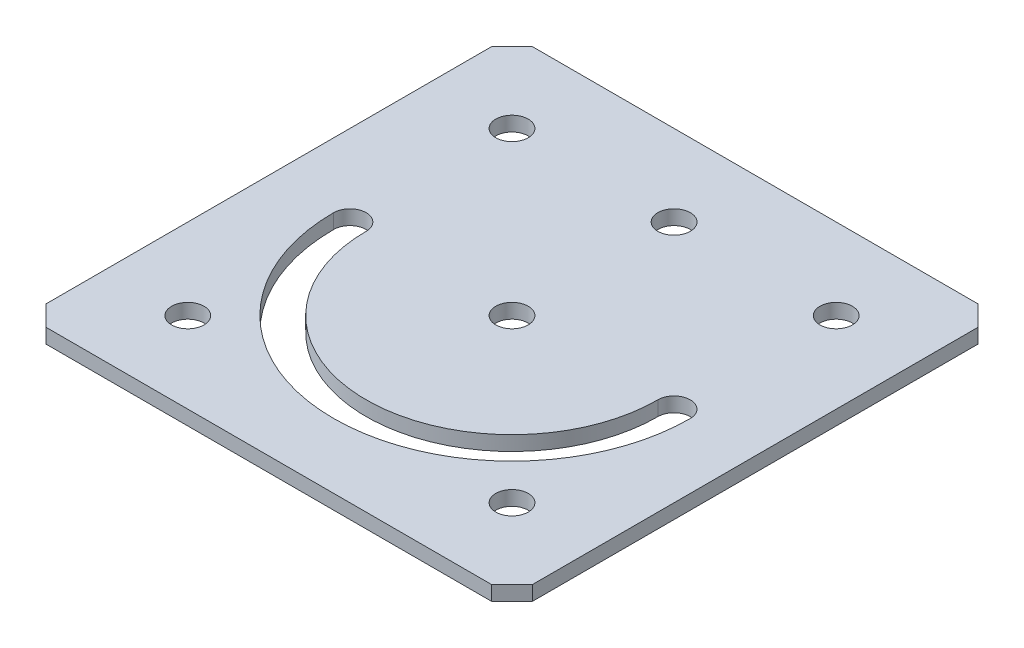
ISO-10303-21;
HEADER;
FILE_DESCRIPTION(('STEP AP214'),'2;1');
FILE_NAME('part.step','',(''),(''),'','','');
FILE_SCHEMA(('AUTOMOTIVE_DESIGN { 1 0 10303 214 1 1 1 1 }'));
ENDSEC;
DATA;
#1=APPLICATION_CONTEXT('core data for automotive mechanical design processes');
#2=APPLICATION_PROTOCOL_DEFINITION('international standard','automotive_design',2000,#1);
#3=PRODUCT_CONTEXT('',#1,'mechanical');
#4=PRODUCT('Part','Part','',(#3));
#5=PRODUCT_RELATED_PRODUCT_CATEGORY('part','',(#4));
#6=PRODUCT_DEFINITION_FORMATION('','',#4);
#7=PRODUCT_DEFINITION_CONTEXT('part definition',#1,'design');
#8=PRODUCT_DEFINITION('design','',#6,#7);
#9=PRODUCT_DEFINITION_SHAPE('','',#8);
#10=(LENGTH_UNIT() NAMED_UNIT(*) SI_UNIT(.MILLI.,.METRE.));
#11=(NAMED_UNIT(*) PLANE_ANGLE_UNIT() SI_UNIT($,.RADIAN.));
#12=(NAMED_UNIT(*) SI_UNIT($,.STERADIAN.) SOLID_ANGLE_UNIT());
#13=UNCERTAINTY_MEASURE_WITH_UNIT(LENGTH_MEASURE(1.E-05),#10,'distance_accuracy_value','');
#14=(GEOMETRIC_REPRESENTATION_CONTEXT(3) GLOBAL_UNCERTAINTY_ASSIGNED_CONTEXT((#13)) GLOBAL_UNIT_ASSIGNED_CONTEXT((#10,
#11,#12)) REPRESENTATION_CONTEXT('',''));
#15=CARTESIAN_POINT('',(0.,0.,0.));
#16=DIRECTION('',(0.,0.,1.));
#17=DIRECTION('',(1.,0.,0.));
#18=AXIS2_PLACEMENT_3D('',#15,#16,#17);
#19=CARTESIAN_POINT('',(0.,3.,0.));
#20=DIRECTION('',(0.,1.,0.));
#21=DIRECTION('',(0.,0.,1.));
#22=AXIS2_PLACEMENT_3D('',#19,#20,#21);
#23=PLANE('',#22);
#24=DIRECTION('',(0.707106781186544,0.,0.707106781186551));
#25=VECTOR('',#24,1.);
#26=CARTESIAN_POINT('',(-63.5,3.,60.325));
#27=LINE('',#26,#25);
#28=CARTESIAN_POINT('',(-60.325,3.,63.5));
#29=VERTEX_POINT('',#28);
#30=CARTESIAN_POINT('',(-63.5,3.,60.3249999999999));
#31=VERTEX_POINT('',#30);
#32=EDGE_CURVE('E435',#29,#31,#27,.F.);
#33=ORIENTED_EDGE('',*,*,#32,.F.);
#34=DIRECTION('',(1.,0.,0.));
#35=VECTOR('',#34,1.);
#36=CARTESIAN_POINT('',(-60.325,3.,63.5));
#37=LINE('',#36,#35);
#38=CARTESIAN_POINT('',(9.52499999999996,3.,63.5));
#39=VERTEX_POINT('',#38);
#40=EDGE_CURVE('E439',#39,#29,#37,.F.);
#41=ORIENTED_EDGE('',*,*,#40,.F.);
#42=DIRECTION('',(0.70710678118655,0.,-0.707106781186546));
#43=VECTOR('',#42,1.);
#44=CARTESIAN_POINT('',(9.52499999999996,3.,63.5));
#45=LINE('',#44,#43);
#46=CARTESIAN_POINT('',(12.7,3.,60.325));
#47=VERTEX_POINT('',#46);
#48=EDGE_CURVE('E443',#47,#39,#45,.F.);
#49=ORIENTED_EDGE('',*,*,#48,.F.);
#50=DIRECTION('',(0.,0.,-1.));
#51=VECTOR('',#50,1.);
#52=CARTESIAN_POINT('',(12.7,3.,60.325));
#53=LINE('',#52,#51);
#54=CARTESIAN_POINT('',(12.7,3.,-9.52499999999999));
#55=VERTEX_POINT('',#54);
#56=EDGE_CURVE('E160',#55,#47,#53,.F.);
#57=ORIENTED_EDGE('',*,*,#56,.F.);
#58=DIRECTION('',(-0.707106781186546,0.,-0.707106781186549));
#59=VECTOR('',#58,1.);
#60=CARTESIAN_POINT('',(12.7,3.,-9.52499999999999));
#61=LINE('',#60,#59);
#62=CARTESIAN_POINT('',(9.525,3.,-12.7));
#63=VERTEX_POINT('',#62);
#64=EDGE_CURVE('E419',#63,#55,#61,.F.);
#65=ORIENTED_EDGE('',*,*,#64,.F.);
#66=DIRECTION('',(-1.,0.,0.));
#67=VECTOR('',#66,1.);
#68=CARTESIAN_POINT('',(9.525,3.,-12.7));
#69=LINE('',#68,#67);
#70=CARTESIAN_POINT('',(-60.325,3.,-12.7));
#71=VERTEX_POINT('',#70);
#72=EDGE_CURVE('E423',#71,#63,#69,.F.);
#73=ORIENTED_EDGE('',*,*,#72,.F.);
#74=DIRECTION('',(-0.707106781186549,0.,0.707106781186546));
#75=VECTOR('',#74,1.);
#76=CARTESIAN_POINT('',(-60.325,3.,-12.7));
#77=LINE('',#76,#75);
#78=CARTESIAN_POINT('',(-63.5,3.,-9.52499999999999));
#79=VERTEX_POINT('',#78);
#80=EDGE_CURVE('E427',#79,#71,#77,.F.);
#81=ORIENTED_EDGE('',*,*,#80,.F.);
#82=DIRECTION('',(0.,0.,1.));
#83=VECTOR('',#82,1.);
#84=CARTESIAN_POINT('',(-63.5,3.,-9.52499999999999));
#85=LINE('',#84,#83);
#86=EDGE_CURVE('E431',#31,#79,#85,.F.);
#87=ORIENTED_EDGE('',*,*,#86,.F.);
#88=EDGE_LOOP('',(#33,#41,#49,#57,#65,#73,#81,#87));
#89=FACE_BOUND('',#88,.T.);
#90=CARTESIAN_POINT('',(-50.8,3.,25.4));
#91=DIRECTION('',(0.,1.,0.));
#92=DIRECTION('',(0.,0.,1.));
#93=AXIS2_PLACEMENT_3D('',#90,#91,#92);
#94=CIRCLE('',#93,2.54);
#95=CARTESIAN_POINT('',(-53.34,3.,25.4));
#96=VERTEX_POINT('',#95);
#97=CARTESIAN_POINT('',(-48.26,3.,25.4));
#98=VERTEX_POINT('',#97);
#99=EDGE_CURVE('E107',#96,#98,#94,.F.);
#100=ORIENTED_EDGE('',*,*,#99,.T.);
#101=CARTESIAN_POINT('',(-25.4,3.,25.4));
#102=DIRECTION('',(0.,1.,0.));
#103=DIRECTION('',(0.,0.,1.));
#104=AXIS2_PLACEMENT_3D('',#101,#102,#103);
#105=CIRCLE('',#104,22.86);
#106=CARTESIAN_POINT('',(-2.53999999999999,3.,25.4));
#107=VERTEX_POINT('',#106);
#108=EDGE_CURVE('E162',#107,#98,#105,.F.);
#109=ORIENTED_EDGE('',*,*,#108,.F.);
#110=CARTESIAN_POINT('',(0.,3.,25.4));
#111=DIRECTION('',(0.,1.,0.));
#112=DIRECTION('',(0.,0.,1.));
#113=AXIS2_PLACEMENT_3D('',#110,#111,#112);
#114=CIRCLE('',#113,2.54);
#115=CARTESIAN_POINT('',(2.54000000000001,3.,25.4));
#116=VERTEX_POINT('',#115);
#117=EDGE_CURVE('E110',#107,#116,#114,.F.);
#118=ORIENTED_EDGE('',*,*,#117,.T.);
#119=CARTESIAN_POINT('',(-25.4,3.,25.4));
#120=DIRECTION('',(0.,1.,0.));
#121=DIRECTION('',(0.,0.,1.));
#122=AXIS2_PLACEMENT_3D('',#119,#120,#121);
#123=CIRCLE('',#122,27.94);
#124=EDGE_CURVE('E104',#116,#96,#123,.F.);
#125=ORIENTED_EDGE('',*,*,#124,.T.);
#126=EDGE_LOOP('',(#100,#109,#118,#125));
#127=FACE_BOUND('',#126,.T.);
#128=CARTESIAN_POINT('',(0.,3.,0.));
#129=DIRECTION('',(0.,1.,0.));
#130=DIRECTION('',(0.,0.,1.));
#131=AXIS2_PLACEMENT_3D('',#128,#129,#130);
#132=CIRCLE('',#131,2.54);
#133=CARTESIAN_POINT('',(0.,3.,2.54000000000001));
#134=VERTEX_POINT('',#133);
#135=EDGE_CURVE('E116',#134,#134,#132,.F.);
#136=ORIENTED_EDGE('',*,*,#135,.T.);
#137=EDGE_LOOP('',(#136));
#138=FACE_BOUND('',#137,.T.);
#139=CARTESIAN_POINT('',(-25.4,3.,0.));
#140=DIRECTION('',(0.,1.,0.));
#141=DIRECTION('',(0.,0.,1.));
#142=AXIS2_PLACEMENT_3D('',#139,#140,#141);
#143=CIRCLE('',#142,2.54);
#144=CARTESIAN_POINT('',(-25.4,3.,2.54000000000001));
#145=VERTEX_POINT('',#144);
#146=EDGE_CURVE('E167',#145,#145,#143,.F.);
#147=ORIENTED_EDGE('',*,*,#146,.T.);
#148=EDGE_LOOP('',(#147));
#149=FACE_BOUND('',#148,.T.);
#150=CARTESIAN_POINT('',(-50.8,3.,0.));
#151=DIRECTION('',(0.,1.,0.));
#152=DIRECTION('',(0.,0.,1.));
#153=AXIS2_PLACEMENT_3D('',#150,#151,#152);
#154=CIRCLE('',#153,2.54);
#155=CARTESIAN_POINT('',(-50.8,3.,2.54000000000001));
#156=VERTEX_POINT('',#155);
#157=EDGE_CURVE('E170',#156,#156,#154,.F.);
#158=ORIENTED_EDGE('',*,*,#157,.T.);
#159=EDGE_LOOP('',(#158));
#160=FACE_BOUND('',#159,.T.);
#161=CARTESIAN_POINT('',(-25.4,3.,25.4));
#162=DIRECTION('',(0.,1.,0.));
#163=DIRECTION('',(0.,0.,1.));
#164=AXIS2_PLACEMENT_3D('',#161,#162,#163);
#165=CIRCLE('',#164,2.54);
#166=CARTESIAN_POINT('',(-25.4,3.,27.94));
#167=VERTEX_POINT('',#166);
#168=EDGE_CURVE('E173',#167,#167,#165,.F.);
#169=ORIENTED_EDGE('',*,*,#168,.T.);
#170=EDGE_LOOP('',(#169));
#171=FACE_BOUND('',#170,.T.);
#172=CARTESIAN_POINT('',(0.,3.,50.8));
#173=DIRECTION('',(0.,1.,0.));
#174=DIRECTION('',(0.,0.,1.));
#175=AXIS2_PLACEMENT_3D('',#172,#173,#174);
#176=CIRCLE('',#175,2.54);
#177=CARTESIAN_POINT('',(0.,3.,53.34));
#178=VERTEX_POINT('',#177);
#179=EDGE_CURVE('E175',#178,#178,#176,.F.);
#180=ORIENTED_EDGE('',*,*,#179,.T.);
#181=EDGE_LOOP('',(#180));
#182=FACE_BOUND('',#181,.T.);
#183=CARTESIAN_POINT('',(-50.8,3.,50.8));
#184=DIRECTION('',(0.,1.,0.));
#185=DIRECTION('',(0.,0.,1.));
#186=AXIS2_PLACEMENT_3D('',#183,#184,#185);
#187=CIRCLE('',#186,2.54);
#188=CARTESIAN_POINT('',(-50.8,3.,53.34));
#189=VERTEX_POINT('',#188);
#190=EDGE_CURVE('E21',#189,#189,#187,.F.);
#191=ORIENTED_EDGE('',*,*,#190,.T.);
#192=EDGE_LOOP('',(#191));
#193=FACE_BOUND('',#192,.T.);
#194=ADVANCED_FACE('F18',(#89,#127,#138,#149,#160,#171,#182,#193),#23,.T.);
#195=CARTESIAN_POINT('',(-50.8,0.714,50.8));
#196=DIRECTION('',(0.,1.,0.));
#197=DIRECTION('',(0.,0.,1.));
#198=AXIS2_PLACEMENT_3D('',#195,#196,#197);
#199=CYLINDRICAL_SURFACE('',#198,2.54);
#200=CARTESIAN_POINT('',(-50.8,0.714,50.8));
#201=DIRECTION('',(0.,1.,0.));
#202=DIRECTION('',(0.,0.,1.));
#203=AXIS2_PLACEMENT_3D('',#200,#201,#202);
#204=CIRCLE('',#203,2.54);
#205=CARTESIAN_POINT('',(-50.8,0.714,53.34));
#206=VERTEX_POINT('',#205);
#207=EDGE_CURVE('E155',#206,#206,#204,.F.);
#208=ORIENTED_EDGE('',*,*,#207,.T.);
#209=EDGE_LOOP('',(#208));
#210=FACE_BOUND('',#209,.T.);
#211=ORIENTED_EDGE('',*,*,#190,.F.);
#212=EDGE_LOOP('',(#211));
#213=FACE_BOUND('',#212,.T.);
#214=ADVANCED_FACE('F183',(#210,#213),#199,.F.);
#215=CARTESIAN_POINT('',(0.,0.714,50.8));
#216=DIRECTION('',(0.,1.,0.));
#217=DIRECTION('',(0.,0.,1.));
#218=AXIS2_PLACEMENT_3D('',#215,#216,#217);
#219=CYLINDRICAL_SURFACE('',#218,2.54);
#220=CARTESIAN_POINT('',(0.,0.714,50.8));
#221=DIRECTION('',(0.,1.,0.));
#222=DIRECTION('',(0.,0.,1.));
#223=AXIS2_PLACEMENT_3D('',#220,#221,#222);
#224=CIRCLE('',#223,2.54);
#225=CARTESIAN_POINT('',(0.,0.714,53.34));
#226=VERTEX_POINT('',#225);
#227=EDGE_CURVE('E152',#226,#226,#224,.F.);
#228=ORIENTED_EDGE('',*,*,#227,.T.);
#229=EDGE_LOOP('',(#228));
#230=FACE_BOUND('',#229,.T.);
#231=ORIENTED_EDGE('',*,*,#179,.F.);
#232=EDGE_LOOP('',(#231));
#233=FACE_BOUND('',#232,.T.);
#234=ADVANCED_FACE('F185',(#230,#233),#219,.F.);
#235=CARTESIAN_POINT('',(-25.4,0.714,25.4));
#236=DIRECTION('',(0.,1.,0.));
#237=DIRECTION('',(0.,0.,1.));
#238=AXIS2_PLACEMENT_3D('',#235,#236,#237);
#239=CYLINDRICAL_SURFACE('',#238,2.54);
#240=CARTESIAN_POINT('',(-25.4,0.714,25.4));
#241=DIRECTION('',(0.,1.,0.));
#242=DIRECTION('',(0.,0.,1.));
#243=AXIS2_PLACEMENT_3D('',#240,#241,#242);
#244=CIRCLE('',#243,2.54);
#245=CARTESIAN_POINT('',(-25.4,0.714,27.94));
#246=VERTEX_POINT('',#245);
#247=EDGE_CURVE('E149',#246,#246,#244,.F.);
#248=ORIENTED_EDGE('',*,*,#247,.T.);
#249=EDGE_LOOP('',(#248));
#250=FACE_BOUND('',#249,.T.);
#251=ORIENTED_EDGE('',*,*,#168,.F.);
#252=EDGE_LOOP('',(#251));
#253=FACE_BOUND('',#252,.T.);
#254=ADVANCED_FACE('F192',(#250,#253),#239,.F.);
#255=CARTESIAN_POINT('',(-50.8,0.714,0.));
#256=DIRECTION('',(0.,1.,0.));
#257=DIRECTION('',(0.,0.,1.));
#258=AXIS2_PLACEMENT_3D('',#255,#256,#257);
#259=CYLINDRICAL_SURFACE('',#258,2.54);
#260=CARTESIAN_POINT('',(-50.8,0.714,0.));
#261=DIRECTION('',(0.,1.,0.));
#262=DIRECTION('',(0.,0.,1.));
#263=AXIS2_PLACEMENT_3D('',#260,#261,#262);
#264=CIRCLE('',#263,2.54);
#265=CARTESIAN_POINT('',(-50.8,0.714,2.54000000000001));
#266=VERTEX_POINT('',#265);
#267=EDGE_CURVE('E146',#266,#266,#264,.F.);
#268=ORIENTED_EDGE('',*,*,#267,.T.);
#269=EDGE_LOOP('',(#268));
#270=FACE_BOUND('',#269,.T.);
#271=ORIENTED_EDGE('',*,*,#157,.F.);
#272=EDGE_LOOP('',(#271));
#273=FACE_BOUND('',#272,.T.);
#274=ADVANCED_FACE('F255',(#270,#273),#259,.F.);
#275=CARTESIAN_POINT('',(-25.4,0.714,0.));
#276=DIRECTION('',(0.,1.,0.));
#277=DIRECTION('',(0.,0.,1.));
#278=AXIS2_PLACEMENT_3D('',#275,#276,#277);
#279=CYLINDRICAL_SURFACE('',#278,2.54);
#280=CARTESIAN_POINT('',(-25.4,0.714,0.));
#281=DIRECTION('',(0.,1.,0.));
#282=DIRECTION('',(0.,0.,1.));
#283=AXIS2_PLACEMENT_3D('',#280,#281,#282);
#284=CIRCLE('',#283,2.54);
#285=CARTESIAN_POINT('',(-25.4,0.714,2.54000000000001));
#286=VERTEX_POINT('',#285);
#287=EDGE_CURVE('E143',#286,#286,#284,.F.);
#288=ORIENTED_EDGE('',*,*,#287,.T.);
#289=EDGE_LOOP('',(#288));
#290=FACE_BOUND('',#289,.T.);
#291=ORIENTED_EDGE('',*,*,#146,.F.);
#292=EDGE_LOOP('',(#291));
#293=FACE_BOUND('',#292,.T.);
#294=ADVANCED_FACE('F251',(#290,#293),#279,.F.);
#295=CARTESIAN_POINT('',(0.,0.714,0.));
#296=DIRECTION('',(0.,1.,0.));
#297=DIRECTION('',(0.,0.,1.));
#298=AXIS2_PLACEMENT_3D('',#295,#296,#297);
#299=CYLINDRICAL_SURFACE('',#298,2.54);
#300=CARTESIAN_POINT('',(0.,0.714,0.));
#301=DIRECTION('',(0.,1.,0.));
#302=DIRECTION('',(0.,0.,1.));
#303=AXIS2_PLACEMENT_3D('',#300,#301,#302);
#304=CIRCLE('',#303,2.54);
#305=CARTESIAN_POINT('',(0.,0.714,2.54000000000001));
#306=VERTEX_POINT('',#305);
#307=EDGE_CURVE('E140',#306,#306,#304,.F.);
#308=ORIENTED_EDGE('',*,*,#307,.T.);
#309=EDGE_LOOP('',(#308));
#310=FACE_BOUND('',#309,.T.);
#311=ORIENTED_EDGE('',*,*,#135,.F.);
#312=EDGE_LOOP('',(#311));
#313=FACE_BOUND('',#312,.T.);
#314=ADVANCED_FACE('F248',(#310,#313),#299,.F.);
#315=CARTESIAN_POINT('',(-25.4,0.714,25.4));
#316=DIRECTION('',(0.,1.,0.));
#317=DIRECTION('',(0.,0.,1.));
#318=AXIS2_PLACEMENT_3D('',#315,#316,#317);
#319=CYLINDRICAL_SURFACE('',#318,27.94);
#320=CARTESIAN_POINT('',(-25.4,0.714,25.4));
#321=DIRECTION('',(0.,1.,0.));
#322=DIRECTION('',(0.,0.,1.));
#323=AXIS2_PLACEMENT_3D('',#320,#321,#322);
#324=CIRCLE('',#323,27.94);
#325=CARTESIAN_POINT('',(2.54000000000001,0.714,25.4));
#326=VERTEX_POINT('',#325);
#327=CARTESIAN_POINT('',(-53.34,0.714,25.4));
#328=VERTEX_POINT('',#327);
#329=EDGE_CURVE('E126',#326,#328,#324,.F.);
#330=ORIENTED_EDGE('',*,*,#329,.T.);
#331=DIRECTION('',(0.,1.,0.));
#332=VECTOR('',#331,1.);
#333=CARTESIAN_POINT('',(-53.34,0.714,25.4));
#334=LINE('',#333,#332);
#335=EDGE_CURVE('E115',#328,#96,#334,.T.);
#336=ORIENTED_EDGE('',*,*,#335,.T.);
#337=ORIENTED_EDGE('',*,*,#124,.F.);
#338=DIRECTION('',(0.,1.,0.));
#339=VECTOR('',#338,1.);
#340=CARTESIAN_POINT('',(2.54,0.714,25.4));
#341=LINE('',#340,#339);
#342=EDGE_CURVE('E163',#116,#326,#341,.F.);
#343=ORIENTED_EDGE('',*,*,#342,.T.);
#344=EDGE_LOOP('',(#330,#336,#337,#343));
#345=FACE_BOUND('',#344,.T.);
#346=ADVANCED_FACE('F125',(#345),#319,.F.);
#347=CARTESIAN_POINT('',(-50.8,0.714,25.4));
#348=DIRECTION('',(0.,1.,0.));
#349=DIRECTION('',(0.,0.,1.));
#350=AXIS2_PLACEMENT_3D('',#347,#348,#349);
#351=CYLINDRICAL_SURFACE('',#350,2.54);
#352=ORIENTED_EDGE('',*,*,#335,.F.);
#353=CARTESIAN_POINT('',(-50.8,0.714,25.4));
#354=DIRECTION('',(0.,1.,0.));
#355=DIRECTION('',(0.,0.,1.));
#356=AXIS2_PLACEMENT_3D('',#353,#354,#355);
#357=CIRCLE('',#356,2.54);
#358=CARTESIAN_POINT('',(-48.26,0.714,25.4));
#359=VERTEX_POINT('',#358);
#360=EDGE_CURVE('E137',#328,#359,#357,.F.);
#361=ORIENTED_EDGE('',*,*,#360,.T.);
#362=DIRECTION('',(0.,1.,0.));
#363=VECTOR('',#362,1.);
#364=CARTESIAN_POINT('',(-48.26,0.714,25.4));
#365=LINE('',#364,#363);
#366=EDGE_CURVE('E123',#98,#359,#365,.F.);
#367=ORIENTED_EDGE('',*,*,#366,.F.);
#368=ORIENTED_EDGE('',*,*,#99,.F.);
#369=EDGE_LOOP('',(#352,#361,#367,#368));
#370=FACE_BOUND('',#369,.T.);
#371=ADVANCED_FACE('F120',(#370),#351,.F.);
#372=CARTESIAN_POINT('',(-25.4,0.714,25.4));
#373=DIRECTION('',(0.,1.,0.));
#374=DIRECTION('',(0.,0.,1.));
#375=AXIS2_PLACEMENT_3D('',#372,#373,#374);
#376=CYLINDRICAL_SURFACE('',#375,22.86);
#377=DIRECTION('',(0.,1.,0.));
#378=VECTOR('',#377,1.);
#379=CARTESIAN_POINT('',(-2.54,0.714,25.4));
#380=LINE('',#379,#378);
#381=CARTESIAN_POINT('',(-2.54,0.714,25.4));
#382=VERTEX_POINT('',#381);
#383=EDGE_CURVE('E161',#382,#107,#380,.T.);
#384=ORIENTED_EDGE('',*,*,#383,.T.);
#385=ORIENTED_EDGE('',*,*,#108,.T.);
#386=ORIENTED_EDGE('',*,*,#366,.T.);
#387=CARTESIAN_POINT('',(-25.4,0.714,25.4));
#388=DIRECTION('',(0.,1.,0.));
#389=DIRECTION('',(0.,0.,1.));
#390=AXIS2_PLACEMENT_3D('',#387,#388,#389);
#391=CIRCLE('',#390,22.86);
#392=EDGE_CURVE('E135',#359,#382,#391,.T.);
#393=ORIENTED_EDGE('',*,*,#392,.T.);
#394=EDGE_LOOP('',(#384,#385,#386,#393));
#395=FACE_BOUND('',#394,.T.);
#396=ADVANCED_FACE('F239',(#395),#376,.T.);
#397=CARTESIAN_POINT('',(0.,0.714,25.4));
#398=DIRECTION('',(0.,1.,0.));
#399=DIRECTION('',(0.,0.,1.));
#400=AXIS2_PLACEMENT_3D('',#397,#398,#399);
#401=CYLINDRICAL_SURFACE('',#400,2.54);
#402=ORIENTED_EDGE('',*,*,#383,.F.);
#403=CARTESIAN_POINT('',(0.,0.714,25.4));
#404=DIRECTION('',(0.,1.,0.));
#405=DIRECTION('',(0.,0.,1.));
#406=AXIS2_PLACEMENT_3D('',#403,#404,#405);
#407=CIRCLE('',#406,2.54);
#408=EDGE_CURVE('E131',#382,#326,#407,.F.);
#409=ORIENTED_EDGE('',*,*,#408,.T.);
#410=ORIENTED_EDGE('',*,*,#342,.F.);
#411=ORIENTED_EDGE('',*,*,#117,.F.);
#412=EDGE_LOOP('',(#402,#409,#410,#411));
#413=FACE_BOUND('',#412,.T.);
#414=ADVANCED_FACE('F235',(#413),#401,.F.);
#415=CARTESIAN_POINT('',(12.7,0.714,60.325));
#416=DIRECTION('',(1.,0.,0.));
#417=DIRECTION('',(0.,0.,-1.));
#418=AXIS2_PLACEMENT_3D('',#415,#416,#417);
#419=PLANE('',#418);
#420=DIRECTION('',(0.,0.,1.));
#421=VECTOR('',#420,1.);
#422=CARTESIAN_POINT('',(12.7,0.714,0.));
#423=LINE('',#422,#421);
#424=CARTESIAN_POINT('',(12.7,0.714,60.325));
#425=VERTEX_POINT('',#424);
#426=CARTESIAN_POINT('',(12.7,0.714,-9.52499999999999));
#427=VERTEX_POINT('',#426);
#428=EDGE_CURVE('E134',#425,#427,#423,.F.);
#429=ORIENTED_EDGE('',*,*,#428,.T.);
#430=DIRECTION('',(0.,1.,0.));
#431=VECTOR('',#430,1.);
#432=CARTESIAN_POINT('',(12.7,0.714,-9.52499999999999));
#433=LINE('',#432,#431);
#434=EDGE_CURVE('E421',#55,#427,#433,.F.);
#435=ORIENTED_EDGE('',*,*,#434,.F.);
#436=ORIENTED_EDGE('',*,*,#56,.T.);
#437=DIRECTION('',(0.,1.,0.));
#438=VECTOR('',#437,1.);
#439=CARTESIAN_POINT('',(12.7,0.714,60.325));
#440=LINE('',#439,#438);
#441=EDGE_CURVE('E158',#425,#47,#440,.T.);
#442=ORIENTED_EDGE('',*,*,#441,.F.);
#443=EDGE_LOOP('',(#429,#435,#436,#442));
#444=FACE_BOUND('',#443,.T.);
#445=ADVANCED_FACE('F231',(#444),#419,.T.);
#446=CARTESIAN_POINT('',(12.7,0.714,-9.52499999999999));
#447=DIRECTION('',(0.707106781186549,0.,-0.707106781186546));
#448=DIRECTION('',(-0.707106781186546,0.,-0.707106781186549));
#449=AXIS2_PLACEMENT_3D('',#446,#447,#448);
#450=PLANE('',#449);
#451=DIRECTION('',(-0.707106781186546,0.,-0.707106781186549));
#452=VECTOR('',#451,1.);
#453=CARTESIAN_POINT('',(12.7,0.714,-9.52499999999999));
#454=LINE('',#453,#452);
#455=CARTESIAN_POINT('',(9.525,0.714,-12.7));
#456=VERTEX_POINT('',#455);
#457=EDGE_CURVE('E450',#427,#456,#454,.T.);
#458=ORIENTED_EDGE('',*,*,#457,.T.);
#459=DIRECTION('',(0.,1.,0.));
#460=VECTOR('',#459,1.);
#461=CARTESIAN_POINT('',(9.525,0.714,-12.7));
#462=LINE('',#461,#460);
#463=EDGE_CURVE('E425',#63,#456,#462,.F.);
#464=ORIENTED_EDGE('',*,*,#463,.F.);
#465=ORIENTED_EDGE('',*,*,#64,.T.);
#466=ORIENTED_EDGE('',*,*,#434,.T.);
#467=EDGE_LOOP('',(#458,#464,#465,#466));
#468=FACE_BOUND('',#467,.T.);
#469=ADVANCED_FACE('F227',(#468),#450,.T.);
#470=CARTESIAN_POINT('',(9.525,0.714,-12.7));
#471=DIRECTION('',(0.,0.,-1.));
#472=DIRECTION('',(-1.,0.,0.));
#473=AXIS2_PLACEMENT_3D('',#470,#471,#472);
#474=PLANE('',#473);
#475=DIRECTION('',(1.,0.,0.));
#476=VECTOR('',#475,1.);
#477=CARTESIAN_POINT('',(0.,0.714,-12.7));
#478=LINE('',#477,#476);
#479=CARTESIAN_POINT('',(-60.325,0.714,-12.7));
#480=VERTEX_POINT('',#479);
#481=EDGE_CURVE('E453',#456,#480,#478,.F.);
#482=ORIENTED_EDGE('',*,*,#481,.T.);
#483=DIRECTION('',(0.,1.,0.));
#484=VECTOR('',#483,1.);
#485=CARTESIAN_POINT('',(-60.325,0.714,-12.7));
#486=LINE('',#485,#484);
#487=EDGE_CURVE('E429',#71,#480,#486,.F.);
#488=ORIENTED_EDGE('',*,*,#487,.F.);
#489=ORIENTED_EDGE('',*,*,#72,.T.);
#490=ORIENTED_EDGE('',*,*,#463,.T.);
#491=EDGE_LOOP('',(#482,#488,#489,#490));
#492=FACE_BOUND('',#491,.T.);
#493=ADVANCED_FACE('F223',(#492),#474,.T.);
#494=CARTESIAN_POINT('',(-60.325,0.714,-12.7));
#495=DIRECTION('',(-0.707106781186546,0.,-0.707106781186549));
#496=DIRECTION('',(-0.707106781186549,0.,0.707106781186546));
#497=AXIS2_PLACEMENT_3D('',#494,#495,#496);
#498=PLANE('',#497);
#499=DIRECTION('',(-0.707106781186549,0.,0.707106781186546));
#500=VECTOR('',#499,1.);
#501=CARTESIAN_POINT('',(-60.325,0.714,-12.7));
#502=LINE('',#501,#500);
#503=CARTESIAN_POINT('',(-63.5,0.714,-9.52499999999999));
#504=VERTEX_POINT('',#503);
#505=EDGE_CURVE('E456',#480,#504,#502,.T.);
#506=ORIENTED_EDGE('',*,*,#505,.T.);
#507=DIRECTION('',(0.,1.,0.));
#508=VECTOR('',#507,1.);
#509=CARTESIAN_POINT('',(-63.5,0.714,-9.52499999999999));
#510=LINE('',#509,#508);
#511=EDGE_CURVE('E433',#79,#504,#510,.F.);
#512=ORIENTED_EDGE('',*,*,#511,.F.);
#513=ORIENTED_EDGE('',*,*,#80,.T.);
#514=ORIENTED_EDGE('',*,*,#487,.T.);
#515=EDGE_LOOP('',(#506,#512,#513,#514));
#516=FACE_BOUND('',#515,.T.);
#517=ADVANCED_FACE('F219',(#516),#498,.T.);
#518=CARTESIAN_POINT('',(-63.5,0.714,-9.52499999999999));
#519=DIRECTION('',(-1.,0.,0.));
#520=DIRECTION('',(0.,0.,1.));
#521=AXIS2_PLACEMENT_3D('',#518,#519,#520);
#522=PLANE('',#521);
#523=DIRECTION('',(0.,0.,1.));
#524=VECTOR('',#523,1.);
#525=CARTESIAN_POINT('',(-63.5,0.714,0.));
#526=LINE('',#525,#524);
#527=CARTESIAN_POINT('',(-63.5,0.714,60.3249999999999));
#528=VERTEX_POINT('',#527);
#529=EDGE_CURVE('E459',#504,#528,#526,.T.);
#530=ORIENTED_EDGE('',*,*,#529,.T.);
#531=DIRECTION('',(0.,1.,0.));
#532=VECTOR('',#531,1.);
#533=CARTESIAN_POINT('',(-63.5,0.714,60.325));
#534=LINE('',#533,#532);
#535=EDGE_CURVE('E437',#31,#528,#534,.F.);
#536=ORIENTED_EDGE('',*,*,#535,.F.);
#537=ORIENTED_EDGE('',*,*,#86,.T.);
#538=ORIENTED_EDGE('',*,*,#511,.T.);
#539=EDGE_LOOP('',(#530,#536,#537,#538));
#540=FACE_BOUND('',#539,.T.);
#541=ADVANCED_FACE('F215',(#540),#522,.T.);
#542=CARTESIAN_POINT('',(-63.5,0.714,60.325));
#543=DIRECTION('',(-0.707106781186551,0.,0.707106781186544));
#544=DIRECTION('',(0.707106781186544,0.,0.707106781186551));
#545=AXIS2_PLACEMENT_3D('',#542,#543,#544);
#546=PLANE('',#545);
#547=DIRECTION('',(0.707106781186544,0.,0.707106781186551));
#548=VECTOR('',#547,1.);
#549=CARTESIAN_POINT('',(-63.5,0.714,60.325));
#550=LINE('',#549,#548);
#551=CARTESIAN_POINT('',(-60.325,0.714,63.5));
#552=VERTEX_POINT('',#551);
#553=EDGE_CURVE('E462',#528,#552,#550,.T.);
#554=ORIENTED_EDGE('',*,*,#553,.T.);
#555=DIRECTION('',(0.,1.,0.));
#556=VECTOR('',#555,1.);
#557=CARTESIAN_POINT('',(-60.325,0.714,63.5));
#558=LINE('',#557,#556);
#559=EDGE_CURVE('E441',#29,#552,#558,.F.);
#560=ORIENTED_EDGE('',*,*,#559,.F.);
#561=ORIENTED_EDGE('',*,*,#32,.T.);
#562=ORIENTED_EDGE('',*,*,#535,.T.);
#563=EDGE_LOOP('',(#554,#560,#561,#562));
#564=FACE_BOUND('',#563,.T.);
#565=ADVANCED_FACE('F211',(#564),#546,.T.);
#566=CARTESIAN_POINT('',(-60.325,0.714,63.5));
#567=DIRECTION('',(0.,0.,1.));
#568=DIRECTION('',(1.,0.,0.));
#569=AXIS2_PLACEMENT_3D('',#566,#567,#568);
#570=PLANE('',#569);
#571=DIRECTION('',(1.,0.,0.));
#572=VECTOR('',#571,1.);
#573=CARTESIAN_POINT('',(0.,0.714,63.5));
#574=LINE('',#573,#572);
#575=CARTESIAN_POINT('',(9.52499999999996,0.714,63.5));
#576=VERTEX_POINT('',#575);
#577=EDGE_CURVE('E27',#552,#576,#574,.T.);
#578=ORIENTED_EDGE('',*,*,#577,.T.);
#579=DIRECTION('',(0.,1.,0.));
#580=VECTOR('',#579,1.);
#581=CARTESIAN_POINT('',(9.52499999999996,0.714,63.5));
#582=LINE('',#581,#580);
#583=EDGE_CURVE('E35',#39,#576,#582,.F.);
#584=ORIENTED_EDGE('',*,*,#583,.F.);
#585=ORIENTED_EDGE('',*,*,#40,.T.);
#586=ORIENTED_EDGE('',*,*,#559,.T.);
#587=EDGE_LOOP('',(#578,#584,#585,#586));
#588=FACE_BOUND('',#587,.T.);
#589=ADVANCED_FACE('F204',(#588),#570,.T.);
#590=CARTESIAN_POINT('',(9.52499999999996,0.714,63.5));
#591=DIRECTION('',(0.707106781186546,0.,0.70710678118655));
#592=DIRECTION('',(0.70710678118655,0.,-0.707106781186546));
#593=AXIS2_PLACEMENT_3D('',#590,#591,#592);
#594=PLANE('',#593);
#595=DIRECTION('',(0.707106781186549,0.,-0.707106781186546));
#596=VECTOR('',#595,1.);
#597=CARTESIAN_POINT('',(9.52499999999996,0.714,63.5));
#598=LINE('',#597,#596);
#599=EDGE_CURVE('E11',#576,#425,#598,.T.);
#600=ORIENTED_EDGE('',*,*,#599,.T.);
#601=ORIENTED_EDGE('',*,*,#441,.T.);
#602=ORIENTED_EDGE('',*,*,#48,.T.);
#603=ORIENTED_EDGE('',*,*,#583,.T.);
#604=EDGE_LOOP('',(#600,#601,#602,#603));
#605=FACE_BOUND('',#604,.T.);
#606=ADVANCED_FACE('F198',(#605),#594,.T.);
#607=CARTESIAN_POINT('',(0.,0.714,0.));
#608=DIRECTION('',(0.,1.,0.));
#609=DIRECTION('',(0.,0.,1.));
#610=AXIS2_PLACEMENT_3D('',#607,#608,#609);
#611=PLANE('',#610);
#612=ORIENTED_EDGE('',*,*,#577,.F.);
#613=ORIENTED_EDGE('',*,*,#553,.F.);
#614=ORIENTED_EDGE('',*,*,#529,.F.);
#615=ORIENTED_EDGE('',*,*,#505,.F.);
#616=ORIENTED_EDGE('',*,*,#481,.F.);
#617=ORIENTED_EDGE('',*,*,#457,.F.);
#618=ORIENTED_EDGE('',*,*,#428,.F.);
#619=ORIENTED_EDGE('',*,*,#599,.F.);
#620=EDGE_LOOP('',(#612,#613,#614,#615,#616,#617,#618,#619));
#621=FACE_BOUND('',#620,.T.);
#622=ORIENTED_EDGE('',*,*,#408,.F.);
#623=ORIENTED_EDGE('',*,*,#392,.F.);
#624=ORIENTED_EDGE('',*,*,#360,.F.);
#625=ORIENTED_EDGE('',*,*,#329,.F.);
#626=EDGE_LOOP('',(#622,#623,#624,#625));
#627=FACE_BOUND('',#626,.T.);
#628=ORIENTED_EDGE('',*,*,#307,.F.);
#629=EDGE_LOOP('',(#628));
#630=FACE_BOUND('',#629,.T.);
#631=ORIENTED_EDGE('',*,*,#287,.F.);
#632=EDGE_LOOP('',(#631));
#633=FACE_BOUND('',#632,.T.);
#634=ORIENTED_EDGE('',*,*,#267,.F.);
#635=EDGE_LOOP('',(#634));
#636=FACE_BOUND('',#635,.T.);
#637=ORIENTED_EDGE('',*,*,#247,.F.);
#638=EDGE_LOOP('',(#637));
#639=FACE_BOUND('',#638,.T.);
#640=ORIENTED_EDGE('',*,*,#227,.F.);
#641=EDGE_LOOP('',(#640));
#642=FACE_BOUND('',#641,.T.);
#643=ORIENTED_EDGE('',*,*,#207,.F.);
#644=EDGE_LOOP('',(#643));
#645=FACE_BOUND('',#644,.T.);
#646=ADVANCED_FACE('F196',(#621,#627,#630,#633,#636,#639,#642,#645),#611,.F.);
#647=CLOSED_SHELL('',(#194,#214,#234,#254,#274,#294,#314,#346,#371,#396,#414,#445,#469,#493,
#517,#541,#565,#589,#606,#646));
#648=MANIFOLD_SOLID_BREP('B1',#647);
#649=ADVANCED_BREP_SHAPE_REPRESENTATION('',(#18,#648),#14);
#650=SHAPE_DEFINITION_REPRESENTATION(#9,#649);
ENDSEC;
END-ISO-10303-21;
